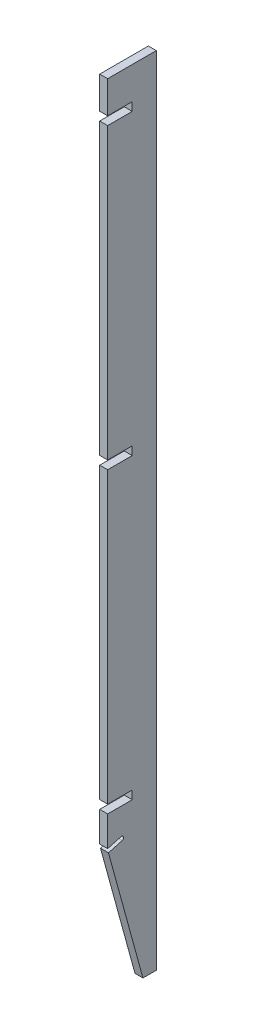
ISO-10303-21;
HEADER;
FILE_DESCRIPTION(('STEP AP214'),'2;1');
FILE_NAME('part.step','',(''),(''),'','','');
FILE_SCHEMA(('AUTOMOTIVE_DESIGN { 1 0 10303 214 1 1 1 1 }'));
ENDSEC;
DATA;
#1=APPLICATION_CONTEXT('core data for automotive mechanical design processes');
#2=APPLICATION_PROTOCOL_DEFINITION('international standard','automotive_design',2000,#1);
#3=PRODUCT_CONTEXT('',#1,'mechanical');
#4=PRODUCT('Part','Part','',(#3));
#5=PRODUCT_RELATED_PRODUCT_CATEGORY('part','',(#4));
#6=PRODUCT_DEFINITION_FORMATION('','',#4);
#7=PRODUCT_DEFINITION_CONTEXT('part definition',#1,'design');
#8=PRODUCT_DEFINITION('design','',#6,#7);
#9=PRODUCT_DEFINITION_SHAPE('','',#8);
#10=(LENGTH_UNIT() NAMED_UNIT(*) SI_UNIT(.MILLI.,.METRE.));
#11=(NAMED_UNIT(*) PLANE_ANGLE_UNIT() SI_UNIT($,.RADIAN.));
#12=(NAMED_UNIT(*) SI_UNIT($,.STERADIAN.) SOLID_ANGLE_UNIT());
#13=UNCERTAINTY_MEASURE_WITH_UNIT(LENGTH_MEASURE(1.E-05),#10,'distance_accuracy_value','');
#14=(GEOMETRIC_REPRESENTATION_CONTEXT(3) GLOBAL_UNCERTAINTY_ASSIGNED_CONTEXT((#13)) GLOBAL_UNIT_ASSIGNED_CONTEXT((#10,
#11,#12)) REPRESENTATION_CONTEXT('',''));
#15=CARTESIAN_POINT('',(0.,0.,0.));
#16=DIRECTION('',(0.,0.,1.));
#17=DIRECTION('',(1.,0.,0.));
#18=AXIS2_PLACEMENT_3D('',#15,#16,#17);
#19=CARTESIAN_POINT('',(-723.646,848.520774128895,76.2));
#20=DIRECTION('',(0.,0.,-1.));
#21=DIRECTION('',(1.,0.,0.));
#22=AXIS2_PLACEMENT_3D('',#19,#20,#21);
#23=PLANE('',#22);
#24=DIRECTION('',(0.,-1.,0.));
#25=VECTOR('',#24,1.);
#26=CARTESIAN_POINT('',(-723.646,848.520774128895,76.2));
#27=LINE('',#26,#25);
#28=CARTESIAN_POINT('',(-723.646,374.269,76.2));
#29=VERTEX_POINT('',#28);
#30=CARTESIAN_POINT('',(-723.646,327.142454536111,76.2));
#31=VERTEX_POINT('',#30);
#32=EDGE_CURVE('E301',#29,#31,#27,.T.);
#33=ORIENTED_EDGE('',*,*,#32,.T.);
#34=DIRECTION('',(1.,0.,0.));
#35=VECTOR('',#34,1.);
#36=CARTESIAN_POINT('',(-723.646,327.142454536111,76.2));
#37=LINE('',#36,#35);
#38=CARTESIAN_POINT('',(-711.2,327.142454536111,76.2));
#39=VERTEX_POINT('',#38);
#40=EDGE_CURVE('E384',#31,#39,#37,.T.);
#41=ORIENTED_EDGE('',*,*,#40,.T.);
#42=DIRECTION('',(0.,-1.,0.));
#43=VECTOR('',#42,1.);
#44=CARTESIAN_POINT('',(-711.2,848.520774128895,76.2));
#45=LINE('',#44,#43);
#46=CARTESIAN_POINT('',(-711.2,374.269,76.2));
#47=VERTEX_POINT('',#46);
#48=EDGE_CURVE('E285',#47,#39,#45,.T.);
#49=ORIENTED_EDGE('',*,*,#48,.F.);
#50=DIRECTION('',(1.,0.,0.));
#51=VECTOR('',#50,1.);
#52=CARTESIAN_POINT('',(-723.646,374.269,76.2));
#53=LINE('',#52,#51);
#54=EDGE_CURVE('E314',#29,#47,#53,.T.);
#55=ORIENTED_EDGE('',*,*,#54,.F.);
#56=EDGE_LOOP('',(#33,#41,#49,#55));
#57=FACE_BOUND('',#56,.T.);
#58=ADVANCED_FACE('F14',(#57),#23,.F.);
#59=DIRECTION('',(-1.,0.,0.));
#60=VECTOR('',#59,1.);
#61=CARTESIAN_POINT('',(-723.646,387.477,76.2));
#62=LINE('',#61,#60);
#63=CARTESIAN_POINT('',(-711.2,387.477,76.2));
#64=VERTEX_POINT('',#63);
#65=CARTESIAN_POINT('',(-723.646,387.477,76.2));
#66=VERTEX_POINT('',#65);
#67=EDGE_CURVE('E321',#64,#66,#62,.T.);
#68=ORIENTED_EDGE('',*,*,#67,.F.);
#69=CARTESIAN_POINT('',(-711.2,841.121,76.2));
#70=VERTEX_POINT('',#69);
#71=EDGE_CURVE('E436',#70,#64,#45,.T.);
#72=ORIENTED_EDGE('',*,*,#71,.F.);
#73=DIRECTION('',(1.,0.,0.));
#74=VECTOR('',#73,1.);
#75=CARTESIAN_POINT('',(-723.646,841.121,76.2));
#76=LINE('',#75,#74);
#77=CARTESIAN_POINT('',(-723.646,841.121,76.2));
#78=VERTEX_POINT('',#77);
#79=EDGE_CURVE('E328',#78,#70,#76,.T.);
#80=ORIENTED_EDGE('',*,*,#79,.F.);
#81=EDGE_CURVE('E459',#78,#66,#27,.T.);
#82=ORIENTED_EDGE('',*,*,#81,.T.);
#83=EDGE_LOOP('',(#68,#72,#80,#82));
#84=FACE_BOUND('',#83,.T.);
#85=ADVANCED_FACE('F476',(#84),#23,.F.);
#86=DIRECTION('',(-1.,0.,0.));
#87=VECTOR('',#86,1.);
#88=CARTESIAN_POINT('',(-723.646,854.329,76.2));
#89=LINE('',#88,#87);
#90=CARTESIAN_POINT('',(-711.2,854.329,76.2));
#91=VERTEX_POINT('',#90);
#92=CARTESIAN_POINT('',(-723.646,854.329,76.2));
#93=VERTEX_POINT('',#92);
#94=EDGE_CURVE('E335',#91,#93,#89,.T.);
#95=ORIENTED_EDGE('',*,*,#94,.F.);
#96=CARTESIAN_POINT('',(-711.2,1307.973,76.2));
#97=VERTEX_POINT('',#96);
#98=EDGE_CURVE('E284',#97,#91,#45,.T.);
#99=ORIENTED_EDGE('',*,*,#98,.F.);
#100=DIRECTION('',(1.,0.,0.));
#101=VECTOR('',#100,1.);
#102=CARTESIAN_POINT('',(-723.646,1307.973,76.2));
#103=LINE('',#102,#101);
#104=CARTESIAN_POINT('',(-723.646,1307.973,76.2));
#105=VERTEX_POINT('',#104);
#106=EDGE_CURVE('E345',#105,#97,#103,.T.);
#107=ORIENTED_EDGE('',*,*,#106,.F.);
#108=EDGE_CURVE('E300',#105,#93,#27,.T.);
#109=ORIENTED_EDGE('',*,*,#108,.T.);
#110=EDGE_LOOP('',(#95,#99,#107,#109));
#111=FACE_BOUND('',#110,.T.);
#112=ADVANCED_FACE('F433',(#111),#23,.F.);
#113=DIRECTION('',(-1.,0.,0.));
#114=VECTOR('',#113,1.);
#115=CARTESIAN_POINT('',(-723.646,1321.181,76.2));
#116=LINE('',#115,#114);
#117=CARTESIAN_POINT('',(-711.2,1321.181,76.2));
#118=VERTEX_POINT('',#117);
#119=CARTESIAN_POINT('',(-723.646,1321.181,76.2));
#120=VERTEX_POINT('',#119);
#121=EDGE_CURVE('E352',#118,#120,#116,.T.);
#122=ORIENTED_EDGE('',*,*,#121,.F.);
#123=CARTESIAN_POINT('',(-711.2,1371.6,76.2));
#124=VERTEX_POINT('',#123);
#125=EDGE_CURVE('E280',#124,#118,#45,.T.);
#126=ORIENTED_EDGE('',*,*,#125,.F.);
#127=DIRECTION('',(1.,0.,0.));
#128=VECTOR('',#127,1.);
#129=CARTESIAN_POINT('',(-723.646,1371.6,76.2));
#130=LINE('',#129,#128);
#131=CARTESIAN_POINT('',(-723.646,1371.6,76.2));
#132=VERTEX_POINT('',#131);
#133=EDGE_CURVE('E271',#132,#124,#130,.T.);
#134=ORIENTED_EDGE('',*,*,#133,.F.);
#135=EDGE_CURVE('E296',#132,#120,#27,.T.);
#136=ORIENTED_EDGE('',*,*,#135,.T.);
#137=EDGE_LOOP('',(#122,#126,#134,#136));
#138=FACE_BOUND('',#137,.T.);
#139=ADVANCED_FACE('F416',(#138),#23,.F.);
#140=CARTESIAN_POINT('',(-723.646,709.727916986039,38.1));
#141=DIRECTION('',(-1.,0.,0.));
#142=DIRECTION('',(0.,1.,0.));
#143=AXIS2_PLACEMENT_3D('',#140,#141,#142);
#144=PLANE('',#143);
#145=DIRECTION('',(0.,0.26471698178117,-0.964326147917118));
#146=VECTOR('',#145,1.);
#147=CARTESIAN_POINT('',(-723.646,363.678082222985,-56.8940722878975));
#148=LINE('',#147,#146);
#149=CARTESIAN_POINT('',(-723.646,332.906598311917,55.2020476738473));
#150=VERTEX_POINT('',#149);
#151=EDGE_CURVE('E364',#31,#150,#148,.T.);
#152=ORIENTED_EDGE('',*,*,#151,.F.);
#153=ORIENTED_EDGE('',*,*,#32,.F.);
#154=DIRECTION('',(0.,0.,-1.));
#155=VECTOR('',#154,1.);
#156=CARTESIAN_POINT('',(-723.646,374.269,38.1));
#157=LINE('',#156,#155);
#158=CARTESIAN_POINT('',(-723.646,374.269,37.719));
#159=VERTEX_POINT('',#158);
#160=EDGE_CURVE('E310',#29,#159,#157,.T.);
#161=ORIENTED_EDGE('',*,*,#160,.T.);
#162=DIRECTION('',(0.,-1.,0.));
#163=VECTOR('',#162,1.);
#164=CARTESIAN_POINT('',(-723.646,709.727916986039,37.719));
#165=LINE('',#164,#163);
#166=CARTESIAN_POINT('',(-723.646,387.477,37.719));
#167=VERTEX_POINT('',#166);
#168=EDGE_CURVE('E293',#167,#159,#165,.T.);
#169=ORIENTED_EDGE('',*,*,#168,.F.);
#170=DIRECTION('',(0.,0.,1.));
#171=VECTOR('',#170,1.);
#172=CARTESIAN_POINT('',(-723.646,387.477,38.1));
#173=LINE('',#172,#171);
#174=EDGE_CURVE('E317',#167,#66,#173,.T.);
#175=ORIENTED_EDGE('',*,*,#174,.T.);
#176=ORIENTED_EDGE('',*,*,#81,.F.);
#177=DIRECTION('',(0.,0.,-1.));
#178=VECTOR('',#177,1.);
#179=CARTESIAN_POINT('',(-723.646,841.121,38.1));
#180=LINE('',#179,#178);
#181=CARTESIAN_POINT('',(-723.646,841.121,37.719));
#182=VERTEX_POINT('',#181);
#183=EDGE_CURVE('E324',#78,#182,#180,.T.);
#184=ORIENTED_EDGE('',*,*,#183,.T.);
#185=DIRECTION('',(0.,-1.,0.));
#186=VECTOR('',#185,1.);
#187=CARTESIAN_POINT('',(-723.646,709.727916986039,37.719));
#188=LINE('',#187,#186);
#189=CARTESIAN_POINT('',(-723.646,854.329,37.719));
#190=VERTEX_POINT('',#189);
#191=EDGE_CURVE('E338',#190,#182,#188,.T.);
#192=ORIENTED_EDGE('',*,*,#191,.F.);
#193=DIRECTION('',(0.,0.,1.));
#194=VECTOR('',#193,1.);
#195=CARTESIAN_POINT('',(-723.646,854.329,38.1));
#196=LINE('',#195,#194);
#197=EDGE_CURVE('E331',#190,#93,#196,.T.);
#198=ORIENTED_EDGE('',*,*,#197,.T.);
#199=ORIENTED_EDGE('',*,*,#108,.F.);
#200=DIRECTION('',(0.,0.,-1.));
#201=VECTOR('',#200,1.);
#202=CARTESIAN_POINT('',(-723.646,1307.973,38.1));
#203=LINE('',#202,#201);
#204=CARTESIAN_POINT('',(-723.646,1307.973,37.719));
#205=VERTEX_POINT('',#204);
#206=EDGE_CURVE('E341',#105,#205,#203,.T.);
#207=ORIENTED_EDGE('',*,*,#206,.T.);
#208=DIRECTION('',(0.,-1.,0.));
#209=VECTOR('',#208,1.);
#210=CARTESIAN_POINT('',(-723.646,709.727916986039,37.719));
#211=LINE('',#210,#209);
#212=CARTESIAN_POINT('',(-723.646,1321.181,37.719));
#213=VERTEX_POINT('',#212);
#214=EDGE_CURVE('E355',#213,#205,#211,.T.);
#215=ORIENTED_EDGE('',*,*,#214,.F.);
#216=DIRECTION('',(0.,0.,1.));
#217=VECTOR('',#216,1.);
#218=CARTESIAN_POINT('',(-723.646,1321.181,38.1));
#219=LINE('',#218,#217);
#220=EDGE_CURVE('E348',#213,#120,#219,.T.);
#221=ORIENTED_EDGE('',*,*,#220,.T.);
#222=ORIENTED_EDGE('',*,*,#135,.F.);
#223=DIRECTION('',(0.,0.,1.));
#224=VECTOR('',#223,1.);
#225=CARTESIAN_POINT('',(-723.646,1371.6,38.1));
#226=LINE('',#225,#224);
#227=CARTESIAN_POINT('',(-723.646,1371.6,0.));
#228=VERTEX_POINT('',#227);
#229=EDGE_CURVE('E302',#228,#132,#226,.T.);
#230=ORIENTED_EDGE('',*,*,#229,.F.);
#231=DIRECTION('',(0.,-1.,0.));
#232=VECTOR('',#231,1.);
#233=CARTESIAN_POINT('',(-723.646,709.727916986039,1.196959198424E-13));
#234=LINE('',#233,#232);
#235=CARTESIAN_POINT('',(-723.646,124.055833972076,2.25611489484112E-13));
#236=VERTEX_POINT('',#235);
#237=EDGE_CURVE('E279',#228,#236,#234,.T.);
#238=ORIENTED_EDGE('',*,*,#237,.T.);
#239=DIRECTION('',(0.,0.,1.));
#240=VECTOR('',#239,1.);
#241=CARTESIAN_POINT('',(-723.646,124.055833972077,38.1000000000125));
#242=LINE('',#241,#240);
#243=CARTESIAN_POINT('',(-723.646,124.055833972077,20.9176470588238));
#244=VERTEX_POINT('',#243);
#245=EDGE_CURVE('E207',#236,#244,#242,.T.);
#246=ORIENTED_EDGE('',*,*,#245,.T.);
#247=DIRECTION('',(0.,-0.964326147917118,-0.26471698178117));
#248=VECTOR('',#247,1.);
#249=CARTESIAN_POINT('',(-723.646,186.648691114934,38.1));
#250=LINE('',#249,#248);
#251=CARTESIAN_POINT('',(-723.646,320.899792352557,74.9532434769948));
#252=VERTEX_POINT('',#251);
#253=EDGE_CURVE('E275',#252,#244,#250,.T.);
#254=ORIENTED_EDGE('',*,*,#253,.F.);
#255=DIRECTION('',(0.,0.26471698178117,-0.964326147917118));
#256=VECTOR('',#255,1.);
#257=CARTESIAN_POINT('',(-723.646,357.554611183711,-58.5750251222078));
#258=LINE('',#257,#256);
#259=CARTESIAN_POINT('',(-723.646,326.783127272644,53.5210948395368));
#260=VERTEX_POINT('',#259);
#261=EDGE_CURVE('E390',#252,#260,#258,.T.);
#262=ORIENTED_EDGE('',*,*,#261,.T.);
#263=CARTESIAN_POINT('',(-723.646,329.844862792281,54.361571256692));
#264=DIRECTION('',(-1.,0.,0.));
#265=DIRECTION('',(0.,-1.,0.));
#266=AXIS2_PLACEMENT_3D('',#263,#264,#265);
#267=CIRCLE('',#266,3.175);
#268=EDGE_CURVE('E214',#150,#260,#267,.T.);
#269=ORIENTED_EDGE('',*,*,#268,.F.);
#270=EDGE_LOOP('',(#152,#153,#161,#169,#175,#176,#184,#192,#198,#199,#207,#215,#221,#222,#230,
#238,#246,#254,#262,#269));
#271=FACE_BOUND('',#270,.T.);
#272=ADVANCED_FACE('F402',(#271),#144,.T.);
#273=CARTESIAN_POINT('',(-711.2,709.727916986039,38.1));
#274=DIRECTION('',(-1.,0.,0.));
#275=DIRECTION('',(0.,1.,0.));
#276=AXIS2_PLACEMENT_3D('',#273,#274,#275);
#277=PLANE('',#276);
#278=ORIENTED_EDGE('',*,*,#48,.T.);
#279=DIRECTION('',(0.,0.26471698178117,-0.964326147917118));
#280=VECTOR('',#279,1.);
#281=CARTESIAN_POINT('',(-711.2,363.678082222985,-56.8940722878975));
#282=LINE('',#281,#280);
#283=CARTESIAN_POINT('',(-711.2,332.906598311917,55.2020476738473));
#284=VERTEX_POINT('',#283);
#285=EDGE_CURVE('E9',#39,#284,#282,.T.);
#286=ORIENTED_EDGE('',*,*,#285,.T.);
#287=CARTESIAN_POINT('',(-711.2,329.844862792281,54.361571256692));
#288=DIRECTION('',(-1.,0.,0.));
#289=DIRECTION('',(0.,-1.,0.));
#290=AXIS2_PLACEMENT_3D('',#287,#288,#289);
#291=CIRCLE('',#290,3.175);
#292=CARTESIAN_POINT('',(-711.2,326.783127272644,53.5210948395368));
#293=VERTEX_POINT('',#292);
#294=EDGE_CURVE('E23',#284,#293,#291,.T.);
#295=ORIENTED_EDGE('',*,*,#294,.T.);
#296=DIRECTION('',(0.,0.26471698178117,-0.964326147917118));
#297=VECTOR('',#296,1.);
#298=CARTESIAN_POINT('',(-711.2,357.554611183711,-58.5750251222078));
#299=LINE('',#298,#297);
#300=CARTESIAN_POINT('',(-711.2,320.899792352557,74.9532434769949));
#301=VERTEX_POINT('',#300);
#302=EDGE_CURVE('E198',#301,#293,#299,.T.);
#303=ORIENTED_EDGE('',*,*,#302,.F.);
#304=DIRECTION('',(0.,-0.964326147917118,-0.26471698178117));
#305=VECTOR('',#304,1.);
#306=CARTESIAN_POINT('',(-711.2,186.648691114934,38.1));
#307=LINE('',#306,#305);
#308=CARTESIAN_POINT('',(-711.2,124.055833972077,20.9176470588238));
#309=VERTEX_POINT('',#308);
#310=EDGE_CURVE('E276',#301,#309,#307,.T.);
#311=ORIENTED_EDGE('',*,*,#310,.T.);
#312=DIRECTION('',(0.,0.,-1.));
#313=VECTOR('',#312,1.);
#314=CARTESIAN_POINT('',(-711.2,124.055833972077,20.9176470588238));
#315=LINE('',#314,#313);
#316=CARTESIAN_POINT('',(-711.2,124.055833972076,2.25611489484112E-13));
#317=VERTEX_POINT('',#316);
#318=EDGE_CURVE('E229',#309,#317,#315,.T.);
#319=ORIENTED_EDGE('',*,*,#318,.T.);
#320=DIRECTION('',(0.,-1.,0.));
#321=VECTOR('',#320,1.);
#322=CARTESIAN_POINT('',(-711.2,709.727916986039,1.196959198424E-13));
#323=LINE('',#322,#321);
#324=CARTESIAN_POINT('',(-711.2,1371.6,0.));
#325=VERTEX_POINT('',#324);
#326=EDGE_CURVE('E290',#325,#317,#323,.T.);
#327=ORIENTED_EDGE('',*,*,#326,.F.);
#328=DIRECTION('',(0.,0.,1.));
#329=VECTOR('',#328,1.);
#330=CARTESIAN_POINT('',(-711.2,1371.6,38.1));
#331=LINE('',#330,#329);
#332=EDGE_CURVE('E286',#325,#124,#331,.T.);
#333=ORIENTED_EDGE('',*,*,#332,.T.);
#334=ORIENTED_EDGE('',*,*,#125,.T.);
#335=DIRECTION('',(0.,0.,1.));
#336=VECTOR('',#335,1.);
#337=CARTESIAN_POINT('',(-711.2,1321.181,38.1));
#338=LINE('',#337,#336);
#339=CARTESIAN_POINT('',(-711.2,1321.181,37.719));
#340=VERTEX_POINT('',#339);
#341=EDGE_CURVE('E260',#340,#118,#338,.T.);
#342=ORIENTED_EDGE('',*,*,#341,.F.);
#343=DIRECTION('',(0.,-1.,0.));
#344=VECTOR('',#343,1.);
#345=CARTESIAN_POINT('',(-711.2,709.727916986039,37.719));
#346=LINE('',#345,#344);
#347=CARTESIAN_POINT('',(-711.2,1307.973,37.719));
#348=VERTEX_POINT('',#347);
#349=EDGE_CURVE('E263',#340,#348,#346,.T.);
#350=ORIENTED_EDGE('',*,*,#349,.T.);
#351=DIRECTION('',(0.,0.,-1.));
#352=VECTOR('',#351,1.);
#353=CARTESIAN_POINT('',(-711.2,1307.973,38.1));
#354=LINE('',#353,#352);
#355=EDGE_CURVE('E256',#97,#348,#354,.T.);
#356=ORIENTED_EDGE('',*,*,#355,.F.);
#357=ORIENTED_EDGE('',*,*,#98,.T.);
#358=DIRECTION('',(0.,0.,1.));
#359=VECTOR('',#358,1.);
#360=CARTESIAN_POINT('',(-711.2,854.329,38.1));
#361=LINE('',#360,#359);
#362=CARTESIAN_POINT('',(-711.2,854.329,37.719));
#363=VERTEX_POINT('',#362);
#364=EDGE_CURVE('E249',#363,#91,#361,.T.);
#365=ORIENTED_EDGE('',*,*,#364,.F.);
#366=DIRECTION('',(0.,-1.,0.));
#367=VECTOR('',#366,1.);
#368=CARTESIAN_POINT('',(-711.2,709.727916986039,37.719));
#369=LINE('',#368,#367);
#370=CARTESIAN_POINT('',(-711.2,841.121,37.719));
#371=VERTEX_POINT('',#370);
#372=EDGE_CURVE('E252',#363,#371,#369,.T.);
#373=ORIENTED_EDGE('',*,*,#372,.T.);
#374=DIRECTION('',(0.,0.,-1.));
#375=VECTOR('',#374,1.);
#376=CARTESIAN_POINT('',(-711.2,841.121,38.1));
#377=LINE('',#376,#375);
#378=EDGE_CURVE('E245',#70,#371,#377,.T.);
#379=ORIENTED_EDGE('',*,*,#378,.F.);
#380=ORIENTED_EDGE('',*,*,#71,.T.);
#381=DIRECTION('',(0.,0.,1.));
#382=VECTOR('',#381,1.);
#383=CARTESIAN_POINT('',(-711.2,387.477,38.1));
#384=LINE('',#383,#382);
#385=CARTESIAN_POINT('',(-711.2,387.477,37.719));
#386=VERTEX_POINT('',#385);
#387=EDGE_CURVE('E242',#386,#64,#384,.T.);
#388=ORIENTED_EDGE('',*,*,#387,.F.);
#389=DIRECTION('',(0.,-1.,0.));
#390=VECTOR('',#389,1.);
#391=CARTESIAN_POINT('',(-711.2,709.727916986039,37.719));
#392=LINE('',#391,#390);
#393=CARTESIAN_POINT('',(-711.2,374.269,37.719));
#394=VERTEX_POINT('',#393);
#395=EDGE_CURVE('E238',#386,#394,#392,.T.);
#396=ORIENTED_EDGE('',*,*,#395,.T.);
#397=DIRECTION('',(0.,0.,-1.));
#398=VECTOR('',#397,1.);
#399=CARTESIAN_POINT('',(-711.2,374.269,38.1));
#400=LINE('',#399,#398);
#401=EDGE_CURVE('E235',#47,#394,#400,.T.);
#402=ORIENTED_EDGE('',*,*,#401,.F.);
#403=EDGE_LOOP('',(#278,#286,#295,#303,#311,#319,#327,#333,#334,#342,#350,#356,#357,#365,#373,
#379,#380,#388,#396,#402));
#404=FACE_BOUND('',#403,.T.);
#405=ADVANCED_FACE('F219',(#404),#277,.F.);
#406=CARTESIAN_POINT('',(-723.646,709.727916986039,1.196959198424E-13));
#407=DIRECTION('',(0.,0.,-1.));
#408=DIRECTION('',(0.,1.,0.));
#409=AXIS2_PLACEMENT_3D('',#406,#407,#408);
#410=PLANE('',#409);
#411=ORIENTED_EDGE('',*,*,#326,.T.);
#412=DIRECTION('',(-1.,0.,0.));
#413=VECTOR('',#412,1.);
#414=CARTESIAN_POINT('',(-723.646,124.055833972076,2.25611489484112E-13));
#415=LINE('',#414,#413);
#416=EDGE_CURVE('E47',#317,#236,#415,.T.);
#417=ORIENTED_EDGE('',*,*,#416,.T.);
#418=ORIENTED_EDGE('',*,*,#237,.F.);
#419=DIRECTION('',(1.,0.,0.));
#420=VECTOR('',#419,1.);
#421=CARTESIAN_POINT('',(-723.646,1371.6,0.));
#422=LINE('',#421,#420);
#423=EDGE_CURVE('E267',#228,#325,#422,.T.);
#424=ORIENTED_EDGE('',*,*,#423,.T.);
#425=EDGE_LOOP('',(#411,#417,#418,#424));
#426=FACE_BOUND('',#425,.T.);
#427=ADVANCED_FACE('F408',(#426),#410,.T.);
#428=CARTESIAN_POINT('',(-723.646,1371.6,38.1));
#429=DIRECTION('',(0.,-1.,0.));
#430=DIRECTION('',(-1.,0.,0.));
#431=AXIS2_PLACEMENT_3D('',#428,#429,#430);
#432=PLANE('',#431);
#433=ORIENTED_EDGE('',*,*,#332,.F.);
#434=ORIENTED_EDGE('',*,*,#423,.F.);
#435=ORIENTED_EDGE('',*,*,#229,.T.);
#436=ORIENTED_EDGE('',*,*,#133,.T.);
#437=EDGE_LOOP('',(#433,#434,#435,#436));
#438=FACE_BOUND('',#437,.T.);
#439=ADVANCED_FACE('F411',(#438),#432,.F.);
#440=CARTESIAN_POINT('',(-723.646,186.648691114934,38.1));
#441=DIRECTION('',(0.,0.26471698178117,-0.964326147917118));
#442=DIRECTION('',(0.,0.964326147917118,0.26471698178117));
#443=AXIS2_PLACEMENT_3D('',#440,#441,#442);
#444=PLANE('',#443);
#445=ORIENTED_EDGE('',*,*,#310,.F.);
#446=DIRECTION('',(-1.,0.,0.));
#447=VECTOR('',#446,1.);
#448=CARTESIAN_POINT('',(2294.93415908109,320.899792352557,74.9532434769948));
#449=LINE('',#448,#447);
#450=EDGE_CURVE('E35',#301,#252,#449,.T.);
#451=ORIENTED_EDGE('',*,*,#450,.T.);
#452=ORIENTED_EDGE('',*,*,#253,.T.);
#453=DIRECTION('',(1.,0.,0.));
#454=VECTOR('',#453,1.);
#455=CARTESIAN_POINT('',(-711.2,124.055833972077,20.9176470588238));
#456=LINE('',#455,#454);
#457=EDGE_CURVE('E232',#244,#309,#456,.T.);
#458=ORIENTED_EDGE('',*,*,#457,.T.);
#459=EDGE_LOOP('',(#445,#451,#452,#458));
#460=FACE_BOUND('',#459,.T.);
#461=ADVANCED_FACE('F399',(#460),#444,.F.);
#462=CARTESIAN_POINT('',(2295.26058781173,847.725,37.719));
#463=DIRECTION('',(0.,0.,-1.));
#464=DIRECTION('',(-1.,0.,0.));
#465=AXIS2_PLACEMENT_3D('',#462,#463,#464);
#466=PLANE('',#465);
#467=ORIENTED_EDGE('',*,*,#214,.T.);
#468=DIRECTION('',(-1.,0.,0.));
#469=VECTOR('',#468,1.);
#470=CARTESIAN_POINT('',(2295.26058781173,1307.973,37.719));
#471=LINE('',#470,#469);
#472=EDGE_CURVE('E359',#348,#205,#471,.T.);
#473=ORIENTED_EDGE('',*,*,#472,.F.);
#474=ORIENTED_EDGE('',*,*,#349,.F.);
#475=DIRECTION('',(-1.,0.,0.));
#476=VECTOR('',#475,1.);
#477=CARTESIAN_POINT('',(2295.26058781173,1321.181,37.719));
#478=LINE('',#477,#476);
#479=EDGE_CURVE('E363',#340,#213,#478,.T.);
#480=ORIENTED_EDGE('',*,*,#479,.T.);
#481=EDGE_LOOP('',(#467,#473,#474,#480));
#482=FACE_BOUND('',#481,.T.);
#483=ADVANCED_FACE('F423',(#482),#466,.F.);
#484=CARTESIAN_POINT('',(2295.26058781173,1307.973,38.1));
#485=DIRECTION('',(0.,1.,0.));
#486=DIRECTION('',(-1.,0.,0.));
#487=AXIS2_PLACEMENT_3D('',#484,#485,#486);
#488=PLANE('',#487);
#489=ORIENTED_EDGE('',*,*,#106,.T.);
#490=ORIENTED_EDGE('',*,*,#355,.T.);
#491=ORIENTED_EDGE('',*,*,#472,.T.);
#492=ORIENTED_EDGE('',*,*,#206,.F.);
#493=EDGE_LOOP('',(#489,#490,#491,#492));
#494=FACE_BOUND('',#493,.T.);
#495=ADVANCED_FACE('F425',(#494),#488,.T.);
#496=CARTESIAN_POINT('',(2295.26058781173,1321.181,38.1));
#497=DIRECTION('',(0.,-1.,0.));
#498=DIRECTION('',(1.,0.,0.));
#499=AXIS2_PLACEMENT_3D('',#496,#497,#498);
#500=PLANE('',#499);
#501=ORIENTED_EDGE('',*,*,#479,.F.);
#502=ORIENTED_EDGE('',*,*,#341,.T.);
#503=ORIENTED_EDGE('',*,*,#121,.T.);
#504=ORIENTED_EDGE('',*,*,#220,.F.);
#505=EDGE_LOOP('',(#501,#502,#503,#504));
#506=FACE_BOUND('',#505,.T.);
#507=ADVANCED_FACE('F419',(#506),#500,.T.);
#508=CARTESIAN_POINT('',(2295.26058781173,847.725,37.719));
#509=DIRECTION('',(0.,0.,-1.));
#510=DIRECTION('',(-1.,0.,0.));
#511=AXIS2_PLACEMENT_3D('',#508,#509,#510);
#512=PLANE('',#511);
#513=ORIENTED_EDGE('',*,*,#191,.T.);
#514=DIRECTION('',(-1.,0.,0.));
#515=VECTOR('',#514,1.);
#516=CARTESIAN_POINT('',(2295.26058781173,841.121,37.719));
#517=LINE('',#516,#515);
#518=EDGE_CURVE('E368',#371,#182,#517,.T.);
#519=ORIENTED_EDGE('',*,*,#518,.F.);
#520=ORIENTED_EDGE('',*,*,#372,.F.);
#521=DIRECTION('',(-1.,0.,0.));
#522=VECTOR('',#521,1.);
#523=CARTESIAN_POINT('',(2295.26058781173,854.329,37.719));
#524=LINE('',#523,#522);
#525=EDGE_CURVE('E369',#363,#190,#524,.T.);
#526=ORIENTED_EDGE('',*,*,#525,.T.);
#527=EDGE_LOOP('',(#513,#519,#520,#526));
#528=FACE_BOUND('',#527,.T.);
#529=ADVANCED_FACE('F474',(#528),#512,.F.);
#530=CARTESIAN_POINT('',(2295.26058781173,841.121,38.1));
#531=DIRECTION('',(0.,1.,0.));
#532=DIRECTION('',(-1.,0.,0.));
#533=AXIS2_PLACEMENT_3D('',#530,#531,#532);
#534=PLANE('',#533);
#535=ORIENTED_EDGE('',*,*,#79,.T.);
#536=ORIENTED_EDGE('',*,*,#378,.T.);
#537=ORIENTED_EDGE('',*,*,#518,.T.);
#538=ORIENTED_EDGE('',*,*,#183,.F.);
#539=EDGE_LOOP('',(#535,#536,#537,#538));
#540=FACE_BOUND('',#539,.T.);
#541=ADVANCED_FACE('F636',(#540),#534,.T.);
#542=CARTESIAN_POINT('',(2295.26058781173,854.329,38.1));
#543=DIRECTION('',(0.,-1.,0.));
#544=DIRECTION('',(1.,0.,0.));
#545=AXIS2_PLACEMENT_3D('',#542,#543,#544);
#546=PLANE('',#545);
#547=ORIENTED_EDGE('',*,*,#525,.F.);
#548=ORIENTED_EDGE('',*,*,#364,.T.);
#549=ORIENTED_EDGE('',*,*,#94,.T.);
#550=ORIENTED_EDGE('',*,*,#197,.F.);
#551=EDGE_LOOP('',(#547,#548,#549,#550));
#552=FACE_BOUND('',#551,.T.);
#553=ADVANCED_FACE('F472',(#552),#546,.T.);
#554=CARTESIAN_POINT('',(2295.26058781173,847.725,37.719));
#555=DIRECTION('',(0.,0.,-1.));
#556=DIRECTION('',(-1.,0.,0.));
#557=AXIS2_PLACEMENT_3D('',#554,#555,#556);
#558=PLANE('',#557);
#559=ORIENTED_EDGE('',*,*,#168,.T.);
#560=DIRECTION('',(-1.,0.,0.));
#561=VECTOR('',#560,1.);
#562=CARTESIAN_POINT('',(2295.26058781173,374.269,37.719));
#563=LINE('',#562,#561);
#564=EDGE_CURVE('E358',#394,#159,#563,.T.);
#565=ORIENTED_EDGE('',*,*,#564,.F.);
#566=ORIENTED_EDGE('',*,*,#395,.F.);
#567=DIRECTION('',(-1.,0.,0.));
#568=VECTOR('',#567,1.);
#569=CARTESIAN_POINT('',(2295.26058781173,387.477,37.719));
#570=LINE('',#569,#568);
#571=EDGE_CURVE('E373',#386,#167,#570,.T.);
#572=ORIENTED_EDGE('',*,*,#571,.T.);
#573=EDGE_LOOP('',(#559,#565,#566,#572));
#574=FACE_BOUND('',#573,.T.);
#575=ADVANCED_FACE('F481',(#574),#558,.F.);
#576=CARTESIAN_POINT('',(2295.26058781173,374.269,44.45));
#577=DIRECTION('',(0.,1.,0.));
#578=DIRECTION('',(-1.,0.,0.));
#579=AXIS2_PLACEMENT_3D('',#576,#577,#578);
#580=PLANE('',#579);
#581=ORIENTED_EDGE('',*,*,#54,.T.);
#582=ORIENTED_EDGE('',*,*,#401,.T.);
#583=ORIENTED_EDGE('',*,*,#564,.T.);
#584=ORIENTED_EDGE('',*,*,#160,.F.);
#585=EDGE_LOOP('',(#581,#582,#583,#584));
#586=FACE_BOUND('',#585,.T.);
#587=ADVANCED_FACE('F484',(#586),#580,.T.);
#588=CARTESIAN_POINT('',(2295.26058781173,387.477,44.45));
#589=DIRECTION('',(0.,-1.,0.));
#590=DIRECTION('',(1.,0.,0.));
#591=AXIS2_PLACEMENT_3D('',#588,#589,#590);
#592=PLANE('',#591);
#593=ORIENTED_EDGE('',*,*,#571,.F.);
#594=ORIENTED_EDGE('',*,*,#387,.T.);
#595=ORIENTED_EDGE('',*,*,#67,.T.);
#596=ORIENTED_EDGE('',*,*,#174,.F.);
#597=EDGE_LOOP('',(#593,#594,#595,#596));
#598=FACE_BOUND('',#597,.T.);
#599=ADVANCED_FACE('F478',(#598),#592,.T.);
#600=CARTESIAN_POINT('',(-723.646,124.055833972077,20.9176470588238));
#601=DIRECTION('',(0.,-1.,0.));
#602=DIRECTION('',(-1.,0.,0.));
#603=AXIS2_PLACEMENT_3D('',#600,#601,#602);
#604=PLANE('',#603);
#605=ORIENTED_EDGE('',*,*,#245,.F.);
#606=ORIENTED_EDGE('',*,*,#416,.F.);
#607=ORIENTED_EDGE('',*,*,#318,.F.);
#608=ORIENTED_EDGE('',*,*,#457,.F.);
#609=EDGE_LOOP('',(#605,#606,#607,#608));
#610=FACE_BOUND('',#609,.T.);
#611=ADVANCED_FACE('F16',(#610),#604,.T.);
#612=CARTESIAN_POINT('',(2294.93415908109,329.844862792281,54.361571256692));
#613=DIRECTION('',(-1.,0.,0.));
#614=DIRECTION('',(0.,-1.,0.));
#615=AXIS2_PLACEMENT_3D('',#612,#613,#614);
#616=CYLINDRICAL_SURFACE('',#615,3.175);
#617=ORIENTED_EDGE('',*,*,#268,.T.);
#618=DIRECTION('',(-1.,0.,0.));
#619=VECTOR('',#618,1.);
#620=CARTESIAN_POINT('',(2294.93415908109,326.783127272644,53.5210948395368));
#621=LINE('',#620,#619);
#622=EDGE_CURVE('E201',#293,#260,#621,.T.);
#623=ORIENTED_EDGE('',*,*,#622,.F.);
#624=ORIENTED_EDGE('',*,*,#294,.F.);
#625=DIRECTION('',(-1.,0.,0.));
#626=VECTOR('',#625,1.);
#627=CARTESIAN_POINT('',(2294.93415908109,332.906598311918,55.2020476738473));
#628=LINE('',#627,#626);
#629=EDGE_CURVE('E216',#284,#150,#628,.T.);
#630=ORIENTED_EDGE('',*,*,#629,.T.);
#631=EDGE_LOOP('',(#617,#623,#624,#630));
#632=FACE_BOUND('',#631,.T.);
#633=ADVANCED_FACE('F210',(#632),#616,.F.);
#634=CARTESIAN_POINT('',(2294.93415908109,323.930746269763,63.9119113500311));
#635=DIRECTION('',(0.,0.964326147917118,0.26471698178117));
#636=DIRECTION('',(0.,-0.26471698178117,0.964326147917118));
#637=AXIS2_PLACEMENT_3D('',#634,#635,#636);
#638=PLANE('',#637);
#639=ORIENTED_EDGE('',*,*,#450,.F.);
#640=ORIENTED_EDGE('',*,*,#302,.T.);
#641=ORIENTED_EDGE('',*,*,#622,.T.);
#642=ORIENTED_EDGE('',*,*,#261,.F.);
#643=EDGE_LOOP('',(#639,#640,#641,#642));
#644=FACE_BOUND('',#643,.T.);
#645=ADVANCED_FACE('F200',(#644),#638,.T.);
#646=CARTESIAN_POINT('',(2294.93415908109,330.049233053331,65.6110211158403));
#647=DIRECTION('',(0.,0.964326147917118,0.26471698178117));
#648=DIRECTION('',(0.,-0.26471698178117,0.964326147917118));
#649=AXIS2_PLACEMENT_3D('',#646,#647,#648);
#650=PLANE('',#649);
#651=ORIENTED_EDGE('',*,*,#151,.T.);
#652=ORIENTED_EDGE('',*,*,#629,.F.);
#653=ORIENTED_EDGE('',*,*,#285,.F.);
#654=ORIENTED_EDGE('',*,*,#40,.F.);
#655=EDGE_LOOP('',(#651,#652,#653,#654));
#656=FACE_BOUND('',#655,.T.);
#657=ADVANCED_FACE('F457',(#656),#650,.F.);
#658=CLOSED_SHELL('',(#58,#85,#112,#139,#272,#405,#427,#439,#461,#483,#495,#507,#529,#541,#553,
#575,#587,#599,#611,#633,#645,#657));
#659=MANIFOLD_SOLID_BREP('B1',#658);
#660=ADVANCED_BREP_SHAPE_REPRESENTATION('',(#18,#659),#14);
#661=SHAPE_DEFINITION_REPRESENTATION(#9,#660);
ENDSEC;
END-ISO-10303-21;
